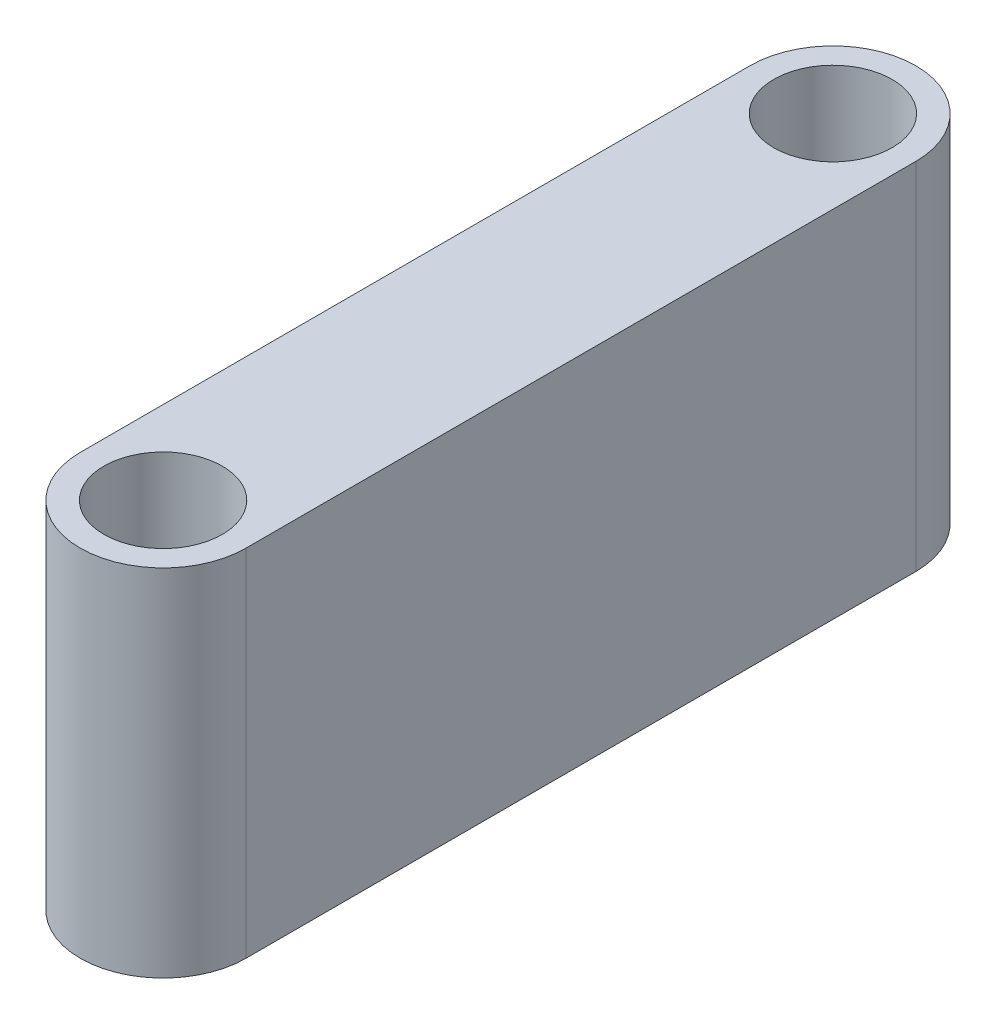
ISO-10303-21;
HEADER;
FILE_DESCRIPTION(('STEP AP214'),'2;1');
FILE_NAME('part.step','',(''),(''),'','','');
FILE_SCHEMA(('AUTOMOTIVE_DESIGN { 1 0 10303 214 1 1 1 1 }'));
ENDSEC;
DATA;
#1=APPLICATION_CONTEXT('core data for automotive mechanical design processes');
#2=APPLICATION_PROTOCOL_DEFINITION('international standard','automotive_design',2000,#1);
#3=PRODUCT_CONTEXT('',#1,'mechanical');
#4=PRODUCT('Part','Part','',(#3));
#5=PRODUCT_RELATED_PRODUCT_CATEGORY('part','',(#4));
#6=PRODUCT_DEFINITION_FORMATION('','',#4);
#7=PRODUCT_DEFINITION_CONTEXT('part definition',#1,'design');
#8=PRODUCT_DEFINITION('design','',#6,#7);
#9=PRODUCT_DEFINITION_SHAPE('','',#8);
#10=(LENGTH_UNIT() NAMED_UNIT(*) SI_UNIT(.MILLI.,.METRE.));
#11=(NAMED_UNIT(*) PLANE_ANGLE_UNIT() SI_UNIT($,.RADIAN.));
#12=(NAMED_UNIT(*) SI_UNIT($,.STERADIAN.) SOLID_ANGLE_UNIT());
#13=UNCERTAINTY_MEASURE_WITH_UNIT(LENGTH_MEASURE(1.E-05),#10,'distance_accuracy_value','');
#14=(GEOMETRIC_REPRESENTATION_CONTEXT(3) GLOBAL_UNCERTAINTY_ASSIGNED_CONTEXT((#13)) GLOBAL_UNIT_ASSIGNED_CONTEXT((#10,
#11,#12)) REPRESENTATION_CONTEXT('',''));
#15=CARTESIAN_POINT('',(0.,0.,0.));
#16=DIRECTION('',(0.,0.,1.));
#17=DIRECTION('',(1.,0.,0.));
#18=AXIS2_PLACEMENT_3D('',#15,#16,#17);
#19=CARTESIAN_POINT('',(17.9605122421383,9.525,-17.9605122421383));
#20=DIRECTION('',(0.,1.,0.));
#21=DIRECTION('',(0.,0.,1.));
#22=AXIS2_PLACEMENT_3D('',#19,#20,#21);
#23=PLANE('',#22);
#24=CARTESIAN_POINT('',(17.9605122421383,9.525,17.9605122421383));
#25=DIRECTION('',(0.,1.,0.));
#26=DIRECTION('',(0.,0.,1.));
#27=AXIS2_PLACEMENT_3D('',#24,#25,#26);
#28=CIRCLE('',#27,3.175);
#29=CARTESIAN_POINT('',(17.9605122421383,9.525,21.1355122421383));
#30=VERTEX_POINT('',#29);
#31=EDGE_CURVE('E106',#30,#30,#28,.T.);
#32=ORIENTED_EDGE('',*,*,#31,.F.);
#33=EDGE_LOOP('',(#32));
#34=FACE_BOUND('',#33,.T.);
#35=CARTESIAN_POINT('',(17.9605122421383,9.525,-17.9605122421383));
#36=DIRECTION('',(0.,1.,0.));
#37=DIRECTION('',(0.,0.,1.));
#38=AXIS2_PLACEMENT_3D('',#35,#36,#37);
#39=CIRCLE('',#38,4.445);
#40=CARTESIAN_POINT('',(22.4055122421383,9.525,-17.9605122421383));
#41=VERTEX_POINT('',#40);
#42=CARTESIAN_POINT('',(13.5155122421383,9.525,-17.9605122421383));
#43=VERTEX_POINT('',#42);
#44=EDGE_CURVE('E91',#41,#43,#39,.T.);
#45=ORIENTED_EDGE('',*,*,#44,.T.);
#46=DIRECTION('',(0.,0.,1.));
#47=VECTOR('',#46,1.);
#48=CARTESIAN_POINT('',(13.5155122421383,9.525,-17.9605122421383));
#49=LINE('',#48,#47);
#50=CARTESIAN_POINT('',(13.5155122421383,9.525,17.9605122421383));
#51=VERTEX_POINT('',#50);
#52=EDGE_CURVE('E86',#43,#51,#49,.T.);
#53=ORIENTED_EDGE('',*,*,#52,.T.);
#54=CARTESIAN_POINT('',(17.9605122421383,9.525,17.9605122421383));
#55=DIRECTION('',(0.,1.,0.));
#56=DIRECTION('',(0.,0.,1.));
#57=AXIS2_PLACEMENT_3D('',#54,#55,#56);
#58=CIRCLE('',#57,4.445);
#59=CARTESIAN_POINT('',(22.4055122421383,9.525,17.9605122421383));
#60=VERTEX_POINT('',#59);
#61=EDGE_CURVE('E89',#51,#60,#58,.T.);
#62=ORIENTED_EDGE('',*,*,#61,.T.);
#63=DIRECTION('',(0.,0.,-1.));
#64=VECTOR('',#63,1.);
#65=CARTESIAN_POINT('',(22.4055122421383,9.525,-17.9605122421383));
#66=LINE('',#65,#64);
#67=EDGE_CURVE('E56',#60,#41,#66,.T.);
#68=ORIENTED_EDGE('',*,*,#67,.T.);
#69=EDGE_LOOP('',(#45,#53,#62,#68));
#70=FACE_BOUND('',#69,.T.);
#71=CARTESIAN_POINT('',(17.9605122421383,9.525,-17.9605122421383));
#72=DIRECTION('',(0.,1.,0.));
#73=DIRECTION('',(0.,0.,1.));
#74=AXIS2_PLACEMENT_3D('',#71,#72,#73);
#75=CIRCLE('',#74,3.175);
#76=CARTESIAN_POINT('',(17.9605122421383,9.525,-14.7855122421383));
#77=VERTEX_POINT('',#76);
#78=EDGE_CURVE('E121',#77,#77,#75,.T.);
#79=ORIENTED_EDGE('',*,*,#78,.F.);
#80=EDGE_LOOP('',(#79));
#81=FACE_BOUND('',#80,.T.);
#82=ADVANCED_FACE('F39',(#34,#70,#81),#23,.T.);
#83=CARTESIAN_POINT('',(17.9605122421383,-9.525,-17.9605122421383));
#84=DIRECTION('',(0.,1.,0.));
#85=DIRECTION('',(0.,0.,1.));
#86=AXIS2_PLACEMENT_3D('',#83,#84,#85);
#87=PLANE('',#86);
#88=CARTESIAN_POINT('',(17.9605122421383,-9.525,-17.9605122421383));
#89=DIRECTION('',(0.,1.,0.));
#90=DIRECTION('',(0.,0.,1.));
#91=AXIS2_PLACEMENT_3D('',#88,#89,#90);
#92=CIRCLE('',#91,4.445);
#93=CARTESIAN_POINT('',(22.4055122421383,-9.525,-17.9605122421383));
#94=VERTEX_POINT('',#93);
#95=CARTESIAN_POINT('',(13.5155122421383,-9.525,-17.9605122421383));
#96=VERTEX_POINT('',#95);
#97=EDGE_CURVE('E103',#94,#96,#92,.T.);
#98=ORIENTED_EDGE('',*,*,#97,.F.);
#99=DIRECTION('',(0.,0.,-1.));
#100=VECTOR('',#99,1.);
#101=CARTESIAN_POINT('',(22.4055122421383,-9.525,-17.9605122421383));
#102=LINE('',#101,#100);
#103=CARTESIAN_POINT('',(22.4055122421383,-9.525,17.9605122421383));
#104=VERTEX_POINT('',#103);
#105=EDGE_CURVE('E79',#104,#94,#102,.T.);
#106=ORIENTED_EDGE('',*,*,#105,.F.);
#107=CARTESIAN_POINT('',(17.9605122421383,-9.525,17.9605122421383));
#108=DIRECTION('',(0.,1.,0.));
#109=DIRECTION('',(0.,0.,1.));
#110=AXIS2_PLACEMENT_3D('',#107,#108,#109);
#111=CIRCLE('',#110,4.445);
#112=CARTESIAN_POINT('',(13.5155122421383,-9.525,17.9605122421383));
#113=VERTEX_POINT('',#112);
#114=EDGE_CURVE('E73',#113,#104,#111,.T.);
#115=ORIENTED_EDGE('',*,*,#114,.F.);
#116=DIRECTION('',(0.,0.,1.));
#117=VECTOR('',#116,1.);
#118=CARTESIAN_POINT('',(13.5155122421383,-9.525,-17.9605122421383));
#119=LINE('',#118,#117);
#120=EDGE_CURVE('E95',#96,#113,#119,.T.);
#121=ORIENTED_EDGE('',*,*,#120,.F.);
#122=EDGE_LOOP('',(#98,#106,#115,#121));
#123=FACE_BOUND('',#122,.T.);
#124=CARTESIAN_POINT('',(17.9605122421383,-9.525,17.9605122421383));
#125=DIRECTION('',(0.,1.,0.));
#126=DIRECTION('',(0.,0.,1.));
#127=AXIS2_PLACEMENT_3D('',#124,#125,#126);
#128=CIRCLE('',#127,3.175);
#129=CARTESIAN_POINT('',(17.9605122421383,-9.525,21.1355122421383));
#130=VERTEX_POINT('',#129);
#131=EDGE_CURVE('E118',#130,#130,#128,.T.);
#132=ORIENTED_EDGE('',*,*,#131,.T.);
#133=EDGE_LOOP('',(#132));
#134=FACE_BOUND('',#133,.T.);
#135=CARTESIAN_POINT('',(17.9605122421383,-9.525,-17.9605122421383));
#136=DIRECTION('',(0.,1.,0.));
#137=DIRECTION('',(0.,0.,1.));
#138=AXIS2_PLACEMENT_3D('',#135,#136,#137);
#139=CIRCLE('',#138,3.175);
#140=CARTESIAN_POINT('',(17.9605122421383,-9.525,-14.7855122421383));
#141=VERTEX_POINT('',#140);
#142=EDGE_CURVE('E124',#141,#141,#139,.T.);
#143=ORIENTED_EDGE('',*,*,#142,.T.);
#144=EDGE_LOOP('',(#143));
#145=FACE_BOUND('',#144,.T.);
#146=ADVANCED_FACE('F114',(#123,#134,#145),#87,.F.);
#147=CARTESIAN_POINT('',(17.9605122421383,9.525,-17.9605122421383));
#148=DIRECTION('',(0.,-1.,0.));
#149=DIRECTION('',(0.,0.,-1.));
#150=AXIS2_PLACEMENT_3D('',#147,#148,#149);
#151=CYLINDRICAL_SURFACE('',#150,4.445);
#152=ORIENTED_EDGE('',*,*,#97,.T.);
#153=DIRECTION('',(0.,-1.,0.));
#154=VECTOR('',#153,1.);
#155=CARTESIAN_POINT('',(13.5155122421383,9.525,-17.9605122421383));
#156=LINE('',#155,#154);
#157=EDGE_CURVE('E11',#43,#96,#156,.T.);
#158=ORIENTED_EDGE('',*,*,#157,.F.);
#159=ORIENTED_EDGE('',*,*,#44,.F.);
#160=DIRECTION('',(0.,-1.,0.));
#161=VECTOR('',#160,1.);
#162=CARTESIAN_POINT('',(22.4055122421383,9.525,-17.9605122421383));
#163=LINE('',#162,#161);
#164=EDGE_CURVE('E99',#41,#94,#163,.T.);
#165=ORIENTED_EDGE('',*,*,#164,.T.);
#166=EDGE_LOOP('',(#152,#158,#159,#165));
#167=FACE_BOUND('',#166,.T.);
#168=ADVANCED_FACE('F41',(#167),#151,.T.);
#169=CARTESIAN_POINT('',(13.5155122421383,9.525,-17.9605122421383));
#170=DIRECTION('',(1.,0.,0.));
#171=DIRECTION('',(0.,0.,-1.));
#172=AXIS2_PLACEMENT_3D('',#169,#170,#171);
#173=PLANE('',#172);
#174=CARTESIAN_POINT('',(13.5155122421383,-6.25,-9.97));
#175=DIRECTION('',(-1.,0.,0.));
#176=DIRECTION('',(0.,0.,1.));
#177=AXIS2_PLACEMENT_3D('',#174,#175,#176);
#178=CIRCLE('',#177,1.95);
#179=CARTESIAN_POINT('',(13.5155122421383,-6.25,-8.02));
#180=VERTEX_POINT('',#179);
#181=EDGE_CURVE('E139',#180,#180,#178,.T.);
#182=ORIENTED_EDGE('',*,*,#181,.F.);
#183=EDGE_LOOP('',(#182));
#184=FACE_BOUND('',#183,.T.);
#185=CARTESIAN_POINT('',(13.5155122421383,-6.25,9.97));
#186=DIRECTION('',(-1.,0.,0.));
#187=DIRECTION('',(0.,0.,1.));
#188=AXIS2_PLACEMENT_3D('',#185,#186,#187);
#189=CIRCLE('',#188,1.95);
#190=CARTESIAN_POINT('',(13.5155122421383,-6.25,11.92));
#191=VERTEX_POINT('',#190);
#192=EDGE_CURVE('E145',#191,#191,#189,.T.);
#193=ORIENTED_EDGE('',*,*,#192,.F.);
#194=EDGE_LOOP('',(#193));
#195=FACE_BOUND('',#194,.T.);
#196=CARTESIAN_POINT('',(13.5155122421383,6.25,9.97));
#197=DIRECTION('',(-1.,0.,0.));
#198=DIRECTION('',(0.,0.,1.));
#199=AXIS2_PLACEMENT_3D('',#196,#197,#198);
#200=CIRCLE('',#199,1.95);
#201=CARTESIAN_POINT('',(13.5155122421383,6.25,11.92));
#202=VERTEX_POINT('',#201);
#203=EDGE_CURVE('E133',#202,#202,#200,.T.);
#204=ORIENTED_EDGE('',*,*,#203,.F.);
#205=EDGE_LOOP('',(#204));
#206=FACE_BOUND('',#205,.T.);
#207=CARTESIAN_POINT('',(13.5155122421383,6.25,-9.97));
#208=DIRECTION('',(-1.,0.,0.));
#209=DIRECTION('',(0.,0.,1.));
#210=AXIS2_PLACEMENT_3D('',#207,#208,#209);
#211=CIRCLE('',#210,1.95);
#212=CARTESIAN_POINT('',(13.5155122421383,6.25,-8.02));
#213=VERTEX_POINT('',#212);
#214=EDGE_CURVE('E130',#213,#213,#211,.T.);
#215=ORIENTED_EDGE('',*,*,#214,.F.);
#216=EDGE_LOOP('',(#215));
#217=FACE_BOUND('',#216,.T.);
#218=ORIENTED_EDGE('',*,*,#120,.T.);
#219=DIRECTION('',(0.,-1.,0.));
#220=VECTOR('',#219,1.);
#221=CARTESIAN_POINT('',(13.5155122421383,9.525,17.9605122421383));
#222=LINE('',#221,#220);
#223=EDGE_CURVE('E48',#51,#113,#222,.T.);
#224=ORIENTED_EDGE('',*,*,#223,.F.);
#225=ORIENTED_EDGE('',*,*,#52,.F.);
#226=ORIENTED_EDGE('',*,*,#157,.T.);
#227=EDGE_LOOP('',(#218,#224,#225,#226));
#228=FACE_BOUND('',#227,.T.);
#229=ADVANCED_FACE('F94',(#184,#195,#206,#217,#228),#173,.F.);
#230=CARTESIAN_POINT('',(17.9605122421383,9.525,17.9605122421383));
#231=DIRECTION('',(0.,-1.,0.));
#232=DIRECTION('',(0.,0.,-1.));
#233=AXIS2_PLACEMENT_3D('',#230,#231,#232);
#234=CYLINDRICAL_SURFACE('',#233,4.445);
#235=ORIENTED_EDGE('',*,*,#114,.T.);
#236=DIRECTION('',(0.,-1.,0.));
#237=VECTOR('',#236,1.);
#238=CARTESIAN_POINT('',(22.4055122421383,9.525,17.9605122421383));
#239=LINE('',#238,#237);
#240=EDGE_CURVE('E96',#60,#104,#239,.T.);
#241=ORIENTED_EDGE('',*,*,#240,.F.);
#242=ORIENTED_EDGE('',*,*,#61,.F.);
#243=ORIENTED_EDGE('',*,*,#223,.T.);
#244=EDGE_LOOP('',(#235,#241,#242,#243));
#245=FACE_BOUND('',#244,.T.);
#246=ADVANCED_FACE('F97',(#245),#234,.T.);
#247=CARTESIAN_POINT('',(22.4055122421383,9.525,-17.9605122421383));
#248=DIRECTION('',(-1.,0.,0.));
#249=DIRECTION('',(0.,0.,1.));
#250=AXIS2_PLACEMENT_3D('',#247,#248,#249);
#251=PLANE('',#250);
#252=ORIENTED_EDGE('',*,*,#105,.T.);
#253=ORIENTED_EDGE('',*,*,#164,.F.);
#254=ORIENTED_EDGE('',*,*,#67,.F.);
#255=ORIENTED_EDGE('',*,*,#240,.T.);
#256=EDGE_LOOP('',(#252,#253,#254,#255));
#257=FACE_BOUND('',#256,.T.);
#258=ADVANCED_FACE('F111',(#257),#251,.F.);
#259=CARTESIAN_POINT('',(17.9605122421383,9.525,17.9605122421383));
#260=DIRECTION('',(0.,-1.,0.));
#261=DIRECTION('',(0.,0.,-1.));
#262=AXIS2_PLACEMENT_3D('',#259,#260,#261);
#263=CYLINDRICAL_SURFACE('',#262,3.175);
#264=ORIENTED_EDGE('',*,*,#31,.T.);
#265=EDGE_LOOP('',(#264));
#266=FACE_BOUND('',#265,.T.);
#267=ORIENTED_EDGE('',*,*,#131,.F.);
#268=EDGE_LOOP('',(#267));
#269=FACE_BOUND('',#268,.T.);
#270=ADVANCED_FACE('F173',(#266,#269),#263,.F.);
#271=CARTESIAN_POINT('',(17.9605122421383,9.525,-17.9605122421383));
#272=DIRECTION('',(0.,-1.,0.));
#273=DIRECTION('',(0.,0.,-1.));
#274=AXIS2_PLACEMENT_3D('',#271,#272,#273);
#275=CYLINDRICAL_SURFACE('',#274,3.175);
#276=ORIENTED_EDGE('',*,*,#78,.T.);
#277=EDGE_LOOP('',(#276));
#278=FACE_BOUND('',#277,.T.);
#279=ORIENTED_EDGE('',*,*,#142,.F.);
#280=EDGE_LOOP('',(#279));
#281=FACE_BOUND('',#280,.T.);
#282=ADVANCED_FACE('F164',(#278,#281),#275,.F.);
#283=CARTESIAN_POINT('',(19.3155122421383,6.25,-9.97));
#284=DIRECTION('',(-1.,0.,0.));
#285=DIRECTION('',(0.,0.,1.));
#286=AXIS2_PLACEMENT_3D('',#283,#284,#285);
#287=CYLINDRICAL_SURFACE('',#286,1.95);
#288=CARTESIAN_POINT('',(19.3155122421383,6.25,-9.97));
#289=DIRECTION('',(-1.,0.,0.));
#290=DIRECTION('',(0.,0.,1.));
#291=AXIS2_PLACEMENT_3D('',#288,#289,#290);
#292=CIRCLE('',#291,1.95);
#293=CARTESIAN_POINT('',(19.3155122421383,6.25,-8.02));
#294=VERTEX_POINT('',#293);
#295=EDGE_CURVE('E127',#294,#294,#292,.T.);
#296=ORIENTED_EDGE('',*,*,#295,.F.);
#297=EDGE_LOOP('',(#296));
#298=FACE_BOUND('',#297,.T.);
#299=ORIENTED_EDGE('',*,*,#214,.T.);
#300=EDGE_LOOP('',(#299));
#301=FACE_BOUND('',#300,.T.);
#302=ADVANCED_FACE('F161',(#298,#301),#287,.F.);
#303=CARTESIAN_POINT('',(19.3155122421383,6.25,-9.97));
#304=DIRECTION('',(-1.,0.,0.));
#305=DIRECTION('',(0.,0.,1.));
#306=AXIS2_PLACEMENT_3D('',#303,#304,#305);
#307=PLANE('',#306);
#308=ORIENTED_EDGE('',*,*,#295,.T.);
#309=EDGE_LOOP('',(#308));
#310=FACE_BOUND('',#309,.T.);
#311=ADVANCED_FACE('F163',(#310),#307,.T.);
#312=CARTESIAN_POINT('',(19.3155122421383,6.25,9.97));
#313=DIRECTION('',(-1.,0.,0.));
#314=DIRECTION('',(0.,0.,1.));
#315=AXIS2_PLACEMENT_3D('',#312,#313,#314);
#316=CYLINDRICAL_SURFACE('',#315,1.95);
#317=CARTESIAN_POINT('',(19.3155122421383,6.25,9.97));
#318=DIRECTION('',(-1.,0.,0.));
#319=DIRECTION('',(0.,0.,1.));
#320=AXIS2_PLACEMENT_3D('',#317,#318,#319);
#321=CIRCLE('',#320,1.95);
#322=CARTESIAN_POINT('',(19.3155122421383,6.25,11.92));
#323=VERTEX_POINT('',#322);
#324=EDGE_CURVE('E148',#323,#323,#321,.T.);
#325=ORIENTED_EDGE('',*,*,#324,.F.);
#326=EDGE_LOOP('',(#325));
#327=FACE_BOUND('',#326,.T.);
#328=ORIENTED_EDGE('',*,*,#203,.T.);
#329=EDGE_LOOP('',(#328));
#330=FACE_BOUND('',#329,.T.);
#331=ADVANCED_FACE('F154',(#327,#330),#316,.F.);
#332=CARTESIAN_POINT('',(19.3155122421383,6.25,9.97));
#333=DIRECTION('',(-1.,0.,0.));
#334=DIRECTION('',(0.,0.,1.));
#335=AXIS2_PLACEMENT_3D('',#332,#333,#334);
#336=PLANE('',#335);
#337=ORIENTED_EDGE('',*,*,#324,.T.);
#338=EDGE_LOOP('',(#337));
#339=FACE_BOUND('',#338,.T.);
#340=ADVANCED_FACE('F253',(#339),#336,.T.);
#341=CARTESIAN_POINT('',(19.3155122421383,-6.25,9.97));
#342=DIRECTION('',(-1.,0.,0.));
#343=DIRECTION('',(0.,0.,1.));
#344=AXIS2_PLACEMENT_3D('',#341,#342,#343);
#345=CYLINDRICAL_SURFACE('',#344,1.95);
#346=CARTESIAN_POINT('',(19.3155122421383,-6.25,9.97));
#347=DIRECTION('',(-1.,0.,0.));
#348=DIRECTION('',(0.,0.,1.));
#349=AXIS2_PLACEMENT_3D('',#346,#347,#348);
#350=CIRCLE('',#349,1.95);
#351=CARTESIAN_POINT('',(19.3155122421383,-6.25,11.92));
#352=VERTEX_POINT('',#351);
#353=EDGE_CURVE('E142',#352,#352,#350,.T.);
#354=ORIENTED_EDGE('',*,*,#353,.F.);
#355=EDGE_LOOP('',(#354));
#356=FACE_BOUND('',#355,.T.);
#357=ORIENTED_EDGE('',*,*,#192,.T.);
#358=EDGE_LOOP('',(#357));
#359=FACE_BOUND('',#358,.T.);
#360=ADVANCED_FACE('F262',(#356,#359),#345,.F.);
#361=CARTESIAN_POINT('',(19.3155122421383,-6.25,9.97));
#362=DIRECTION('',(-1.,0.,0.));
#363=DIRECTION('',(0.,0.,1.));
#364=AXIS2_PLACEMENT_3D('',#361,#362,#363);
#365=PLANE('',#364);
#366=ORIENTED_EDGE('',*,*,#353,.T.);
#367=EDGE_LOOP('',(#366));
#368=FACE_BOUND('',#367,.T.);
#369=ADVANCED_FACE('F271',(#368),#365,.T.);
#370=CARTESIAN_POINT('',(19.3155122421383,-6.25,-9.97));
#371=DIRECTION('',(-1.,0.,0.));
#372=DIRECTION('',(0.,0.,1.));
#373=AXIS2_PLACEMENT_3D('',#370,#371,#372);
#374=CYLINDRICAL_SURFACE('',#373,1.95);
#375=CARTESIAN_POINT('',(19.3155122421383,-6.25,-9.97));
#376=DIRECTION('',(-1.,0.,0.));
#377=DIRECTION('',(0.,0.,1.));
#378=AXIS2_PLACEMENT_3D('',#375,#376,#377);
#379=CIRCLE('',#378,1.95);
#380=CARTESIAN_POINT('',(19.3155122421383,-6.25,-8.02));
#381=VERTEX_POINT('',#380);
#382=EDGE_CURVE('E136',#381,#381,#379,.T.);
#383=ORIENTED_EDGE('',*,*,#382,.F.);
#384=EDGE_LOOP('',(#383));
#385=FACE_BOUND('',#384,.T.);
#386=ORIENTED_EDGE('',*,*,#181,.T.);
#387=EDGE_LOOP('',(#386));
#388=FACE_BOUND('',#387,.T.);
#389=ADVANCED_FACE('F280',(#385,#388),#374,.F.);
#390=CARTESIAN_POINT('',(19.3155122421383,-6.25,-9.97));
#391=DIRECTION('',(-1.,0.,0.));
#392=DIRECTION('',(0.,0.,1.));
#393=AXIS2_PLACEMENT_3D('',#390,#391,#392);
#394=PLANE('',#393);
#395=ORIENTED_EDGE('',*,*,#382,.T.);
#396=EDGE_LOOP('',(#395));
#397=FACE_BOUND('',#396,.T.);
#398=ADVANCED_FACE('F289',(#397),#394,.T.);
#399=CLOSED_SHELL('',(#82,#146,#168,#229,#246,#258,#270,#282,#302,#311,#331,#340,#360,#369,#389,#398));
#400=MANIFOLD_SOLID_BREP('B2',#399);
#401=ADVANCED_BREP_SHAPE_REPRESENTATION('',(#18,#400),#14);
#402=SHAPE_DEFINITION_REPRESENTATION(#9,#401);
ENDSEC;
END-ISO-10303-21;
